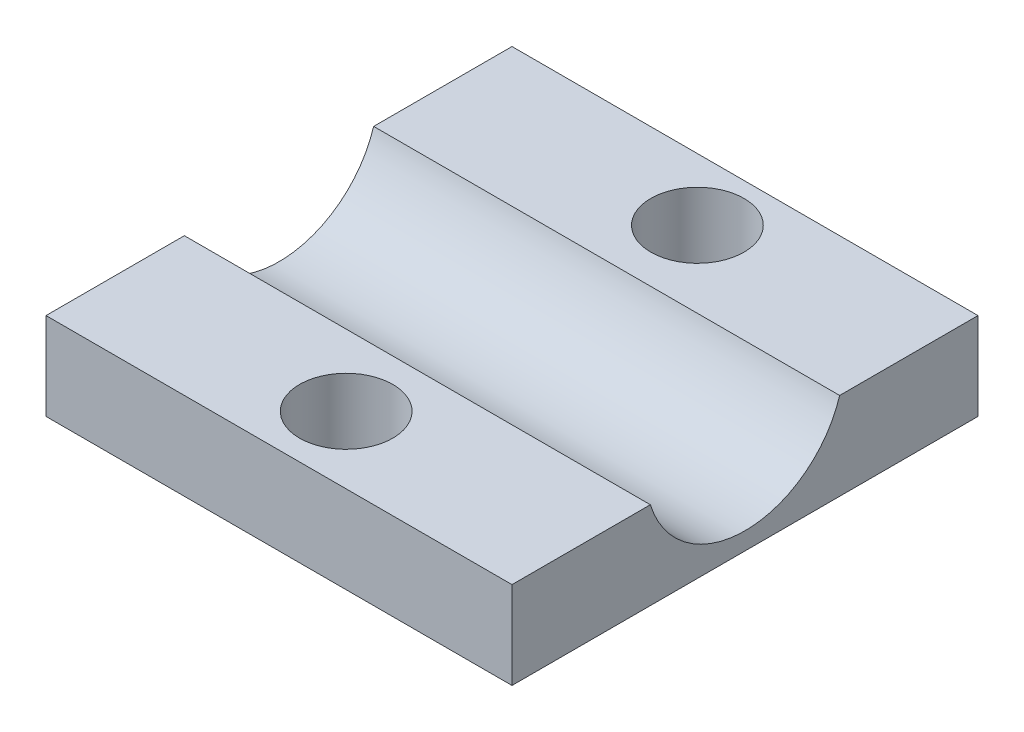
ISO-10303-21;
HEADER;
FILE_DESCRIPTION(('STEP AP214'),'2;1');
FILE_NAME('part.step','',(''),(''),'','','');
FILE_SCHEMA(('AUTOMOTIVE_DESIGN { 1 0 10303 214 1 1 1 1 }'));
ENDSEC;
DATA;
#1=APPLICATION_CONTEXT('core data for automotive mechanical design processes');
#2=APPLICATION_PROTOCOL_DEFINITION('international standard','automotive_design',2000,#1);
#3=PRODUCT_CONTEXT('',#1,'mechanical');
#4=PRODUCT('Part','Part','',(#3));
#5=PRODUCT_RELATED_PRODUCT_CATEGORY('part','',(#4));
#6=PRODUCT_DEFINITION_FORMATION('','',#4);
#7=PRODUCT_DEFINITION_CONTEXT('part definition',#1,'design');
#8=PRODUCT_DEFINITION('design','',#6,#7);
#9=PRODUCT_DEFINITION_SHAPE('','',#8);
#10=(LENGTH_UNIT() NAMED_UNIT(*) SI_UNIT(.MILLI.,.METRE.));
#11=(NAMED_UNIT(*) PLANE_ANGLE_UNIT() SI_UNIT($,.RADIAN.));
#12=(NAMED_UNIT(*) SI_UNIT($,.STERADIAN.) SOLID_ANGLE_UNIT());
#13=UNCERTAINTY_MEASURE_WITH_UNIT(LENGTH_MEASURE(1.E-05),#10,'distance_accuracy_value','');
#14=(GEOMETRIC_REPRESENTATION_CONTEXT(3) GLOBAL_UNCERTAINTY_ASSIGNED_CONTEXT((#13)) GLOBAL_UNIT_ASSIGNED_CONTEXT((#10,
#11,#12)) REPRESENTATION_CONTEXT('',''));
#15=CARTESIAN_POINT('',(0.,0.,0.));
#16=DIRECTION('',(0.,0.,1.));
#17=DIRECTION('',(1.,0.,0.));
#18=AXIS2_PLACEMENT_3D('',#15,#16,#17);
#19=CARTESIAN_POINT('',(0.,7.5,0.));
#20=DIRECTION('',(0.,1.,0.));
#21=DIRECTION('',(0.,0.,1.));
#22=AXIS2_PLACEMENT_3D('',#19,#20,#21);
#23=PLANE('',#22);
#24=CARTESIAN_POINT('',(1.24722686358325,7.5,-14.6672284541437));
#25=DIRECTION('',(0.,1.,0.));
#26=DIRECTION('',(0.,0.,1.));
#27=AXIS2_PLACEMENT_3D('',#24,#25,#26);
#28=CIRCLE('',#27,3.99999999999999);
#29=CARTESIAN_POINT('',(1.24722686358325,7.5,-10.6672284541437));
#30=VERTEX_POINT('',#29);
#31=EDGE_CURVE('E233',#30,#30,#28,.T.);
#32=ORIENTED_EDGE('',*,*,#31,.F.);
#33=EDGE_LOOP('',(#32));
#34=FACE_BOUND('',#33,.T.);
#35=DIRECTION('',(0.,0.,1.));
#36=VECTOR('',#35,1.);
#37=CARTESIAN_POINT('',(-20.,7.5,20.));
#38=LINE('',#37,#36);
#39=CARTESIAN_POINT('',(-20.,7.5,-20.));
#40=VERTEX_POINT('',#39);
#41=CARTESIAN_POINT('',(-20.,7.5,-8.12403840463596));
#42=VERTEX_POINT('',#41);
#43=EDGE_CURVE('E99',#40,#42,#38,.T.);
#44=ORIENTED_EDGE('',*,*,#43,.T.);
#45=DIRECTION('',(-1.,0.,0.));
#46=VECTOR('',#45,1.);
#47=CARTESIAN_POINT('',(20.,7.5,-8.12403840463596));
#48=LINE('',#47,#46);
#49=CARTESIAN_POINT('',(20.,7.5,-8.12403840463596));
#50=VERTEX_POINT('',#49);
#51=EDGE_CURVE('E11',#42,#50,#48,.F.);
#52=ORIENTED_EDGE('',*,*,#51,.T.);
#53=DIRECTION('',(0.,0.,-1.));
#54=VECTOR('',#53,1.);
#55=CARTESIAN_POINT('',(20.,7.5,20.));
#56=LINE('',#55,#54);
#57=CARTESIAN_POINT('',(20.,7.5,-20.));
#58=VERTEX_POINT('',#57);
#59=EDGE_CURVE('E105',#50,#58,#56,.T.);
#60=ORIENTED_EDGE('',*,*,#59,.T.);
#61=DIRECTION('',(-1.,0.,0.));
#62=VECTOR('',#61,1.);
#63=CARTESIAN_POINT('',(20.,7.5,-20.));
#64=LINE('',#63,#62);
#65=EDGE_CURVE('E57',#58,#40,#64,.T.);
#66=ORIENTED_EDGE('',*,*,#65,.T.);
#67=EDGE_LOOP('',(#44,#52,#60,#66));
#68=FACE_BOUND('',#67,.T.);
#69=ADVANCED_FACE('F33',(#34,#68),#23,.T.);
#70=CARTESIAN_POINT('',(0.,7.5,14.2327715458563));
#71=DIRECTION('',(0.,1.,0.));
#72=DIRECTION('',(0.,0.,1.));
#73=AXIS2_PLACEMENT_3D('',#70,#71,#72);
#74=CIRCLE('',#73,3.99999999999999);
#75=CARTESIAN_POINT('',(0.,7.5,18.2327715458563));
#76=VERTEX_POINT('',#75);
#77=EDGE_CURVE('E235',#76,#76,#74,.T.);
#78=ORIENTED_EDGE('',*,*,#77,.F.);
#79=EDGE_LOOP('',(#78));
#80=FACE_BOUND('',#79,.T.);
#81=CARTESIAN_POINT('',(20.,7.5,20.));
#82=VERTEX_POINT('',#81);
#83=CARTESIAN_POINT('',(20.,7.5,8.12403840463596));
#84=VERTEX_POINT('',#83);
#85=EDGE_CURVE('E109',#82,#84,#56,.T.);
#86=ORIENTED_EDGE('',*,*,#85,.T.);
#87=DIRECTION('',(-1.,0.,0.));
#88=VECTOR('',#87,1.);
#89=CARTESIAN_POINT('',(20.,7.5,8.12403840463596));
#90=LINE('',#89,#88);
#91=CARTESIAN_POINT('',(-20.,7.5,8.12403840463596));
#92=VERTEX_POINT('',#91);
#93=EDGE_CURVE('E41',#84,#92,#90,.T.);
#94=ORIENTED_EDGE('',*,*,#93,.T.);
#95=CARTESIAN_POINT('',(-20.,7.5,20.));
#96=VERTEX_POINT('',#95);
#97=EDGE_CURVE('E85',#92,#96,#38,.T.);
#98=ORIENTED_EDGE('',*,*,#97,.T.);
#99=DIRECTION('',(1.,0.,0.));
#100=VECTOR('',#99,1.);
#101=CARTESIAN_POINT('',(20.,7.5,20.));
#102=LINE('',#101,#100);
#103=EDGE_CURVE('E103',#96,#82,#102,.T.);
#104=ORIENTED_EDGE('',*,*,#103,.T.);
#105=EDGE_LOOP('',(#86,#94,#98,#104));
#106=FACE_BOUND('',#105,.T.);
#107=ADVANCED_FACE('F130',(#80,#106),#23,.T.);
#108=CARTESIAN_POINT('',(-20.,7.5,20.));
#109=DIRECTION('',(1.,0.,0.));
#110=DIRECTION('',(0.,0.,-1.));
#111=AXIS2_PLACEMENT_3D('',#108,#109,#110);
#112=PLANE('',#111);
#113=CARTESIAN_POINT('',(-20.,10.,0.));
#114=DIRECTION('',(1.,0.,0.));
#115=DIRECTION('',(0.,0.,-1.));
#116=AXIS2_PLACEMENT_3D('',#113,#114,#115);
#117=CIRCLE('',#116,8.5);
#118=EDGE_CURVE('E48',#92,#42,#117,.T.);
#119=ORIENTED_EDGE('',*,*,#118,.T.);
#120=ORIENTED_EDGE('',*,*,#43,.F.);
#121=DIRECTION('',(0.,-1.,0.));
#122=VECTOR('',#121,1.);
#123=CARTESIAN_POINT('',(-20.,7.5,-20.));
#124=LINE('',#123,#122);
#125=CARTESIAN_POINT('',(-20.,0.,-20.));
#126=VERTEX_POINT('',#125);
#127=EDGE_CURVE('E113',#40,#126,#124,.T.);
#128=ORIENTED_EDGE('',*,*,#127,.T.);
#129=DIRECTION('',(0.,0.,1.));
#130=VECTOR('',#129,1.);
#131=CARTESIAN_POINT('',(-20.,0.,20.));
#132=LINE('',#131,#130);
#133=CARTESIAN_POINT('',(-20.,0.,20.));
#134=VERTEX_POINT('',#133);
#135=EDGE_CURVE('E114',#126,#134,#132,.T.);
#136=ORIENTED_EDGE('',*,*,#135,.T.);
#137=DIRECTION('',(0.,-1.,0.));
#138=VECTOR('',#137,1.);
#139=CARTESIAN_POINT('',(-20.,7.5,20.));
#140=LINE('',#139,#138);
#141=EDGE_CURVE('E128',#96,#134,#140,.T.);
#142=ORIENTED_EDGE('',*,*,#141,.F.);
#143=ORIENTED_EDGE('',*,*,#97,.F.);
#144=EDGE_LOOP('',(#119,#120,#128,#136,#142,#143));
#145=FACE_BOUND('',#144,.T.);
#146=ADVANCED_FACE('F35',(#145),#112,.F.);
#147=CARTESIAN_POINT('',(20.,7.5,20.));
#148=DIRECTION('',(0.,0.,-1.));
#149=DIRECTION('',(-1.,0.,0.));
#150=AXIS2_PLACEMENT_3D('',#147,#148,#149);
#151=PLANE('',#150);
#152=DIRECTION('',(1.,0.,0.));
#153=VECTOR('',#152,1.);
#154=CARTESIAN_POINT('',(20.,0.,20.));
#155=LINE('',#154,#153);
#156=CARTESIAN_POINT('',(20.,0.,20.));
#157=VERTEX_POINT('',#156);
#158=EDGE_CURVE('E117',#134,#157,#155,.T.);
#159=ORIENTED_EDGE('',*,*,#158,.T.);
#160=DIRECTION('',(0.,-1.,0.));
#161=VECTOR('',#160,1.);
#162=CARTESIAN_POINT('',(20.,7.5,20.));
#163=LINE('',#162,#161);
#164=EDGE_CURVE('E125',#82,#157,#163,.T.);
#165=ORIENTED_EDGE('',*,*,#164,.F.);
#166=ORIENTED_EDGE('',*,*,#103,.F.);
#167=ORIENTED_EDGE('',*,*,#141,.T.);
#168=EDGE_LOOP('',(#159,#165,#166,#167));
#169=FACE_BOUND('',#168,.T.);
#170=ADVANCED_FACE('F142',(#169),#151,.F.);
#171=CARTESIAN_POINT('',(20.,7.5,20.));
#172=DIRECTION('',(-1.,0.,0.));
#173=DIRECTION('',(0.,0.,1.));
#174=AXIS2_PLACEMENT_3D('',#171,#172,#173);
#175=PLANE('',#174);
#176=CARTESIAN_POINT('',(20.,10.,0.));
#177=DIRECTION('',(1.,0.,0.));
#178=DIRECTION('',(0.,0.,-1.));
#179=AXIS2_PLACEMENT_3D('',#176,#177,#178);
#180=CIRCLE('',#179,8.5);
#181=EDGE_CURVE('E95',#84,#50,#180,.T.);
#182=ORIENTED_EDGE('',*,*,#181,.F.);
#183=ORIENTED_EDGE('',*,*,#85,.F.);
#184=ORIENTED_EDGE('',*,*,#164,.T.);
#185=DIRECTION('',(0.,0.,-1.));
#186=VECTOR('',#185,1.);
#187=CARTESIAN_POINT('',(20.,0.,20.));
#188=LINE('',#187,#186);
#189=CARTESIAN_POINT('',(20.,0.,-20.));
#190=VERTEX_POINT('',#189);
#191=EDGE_CURVE('E119',#157,#190,#188,.T.);
#192=ORIENTED_EDGE('',*,*,#191,.T.);
#193=DIRECTION('',(0.,-1.,0.));
#194=VECTOR('',#193,1.);
#195=CARTESIAN_POINT('',(20.,7.5,-20.));
#196=LINE('',#195,#194);
#197=EDGE_CURVE('E123',#58,#190,#196,.T.);
#198=ORIENTED_EDGE('',*,*,#197,.F.);
#199=ORIENTED_EDGE('',*,*,#59,.F.);
#200=EDGE_LOOP('',(#182,#183,#184,#192,#198,#199));
#201=FACE_BOUND('',#200,.T.);
#202=ADVANCED_FACE('F133',(#201),#175,.F.);
#203=CARTESIAN_POINT('',(20.,7.5,-20.));
#204=DIRECTION('',(0.,0.,1.));
#205=DIRECTION('',(1.,0.,0.));
#206=AXIS2_PLACEMENT_3D('',#203,#204,#205);
#207=PLANE('',#206);
#208=DIRECTION('',(-1.,0.,0.));
#209=VECTOR('',#208,1.);
#210=CARTESIAN_POINT('',(20.,0.,-20.));
#211=LINE('',#210,#209);
#212=EDGE_CURVE('E78',#190,#126,#211,.T.);
#213=ORIENTED_EDGE('',*,*,#212,.T.);
#214=ORIENTED_EDGE('',*,*,#127,.F.);
#215=ORIENTED_EDGE('',*,*,#65,.F.);
#216=ORIENTED_EDGE('',*,*,#197,.T.);
#217=EDGE_LOOP('',(#213,#214,#215,#216));
#218=FACE_BOUND('',#217,.T.);
#219=ADVANCED_FACE('F136',(#218),#207,.F.);
#220=CARTESIAN_POINT('',(0.,0.,0.));
#221=DIRECTION('',(0.,1.,0.));
#222=DIRECTION('',(0.,0.,1.));
#223=AXIS2_PLACEMENT_3D('',#220,#221,#222);
#224=PLANE('',#223);
#225=CARTESIAN_POINT('',(1.24722686358325,0.,-14.6672284541437));
#226=DIRECTION('',(0.,1.,0.));
#227=DIRECTION('',(0.,0.,1.));
#228=AXIS2_PLACEMENT_3D('',#225,#226,#227);
#229=CIRCLE('',#228,3.99999999999995);
#230=CARTESIAN_POINT('',(1.24722686358325,0.,-10.6672284541437));
#231=VERTEX_POINT('',#230);
#232=EDGE_CURVE('E231',#231,#231,#229,.T.);
#233=ORIENTED_EDGE('',*,*,#232,.T.);
#234=EDGE_LOOP('',(#233));
#235=FACE_BOUND('',#234,.T.);
#236=CARTESIAN_POINT('',(0.,0.,14.2327715458563));
#237=DIRECTION('',(0.,1.,0.));
#238=DIRECTION('',(0.,0.,1.));
#239=AXIS2_PLACEMENT_3D('',#236,#237,#238);
#240=CIRCLE('',#239,3.99999999999995);
#241=CARTESIAN_POINT('',(0.,0.,18.2327715458563));
#242=VERTEX_POINT('',#241);
#243=EDGE_CURVE('E101',#242,#242,#240,.T.);
#244=ORIENTED_EDGE('',*,*,#243,.T.);
#245=EDGE_LOOP('',(#244));
#246=FACE_BOUND('',#245,.T.);
#247=ORIENTED_EDGE('',*,*,#135,.F.);
#248=ORIENTED_EDGE('',*,*,#212,.F.);
#249=ORIENTED_EDGE('',*,*,#191,.F.);
#250=ORIENTED_EDGE('',*,*,#158,.F.);
#251=EDGE_LOOP('',(#247,#248,#249,#250));
#252=FACE_BOUND('',#251,.T.);
#253=ADVANCED_FACE('F139',(#235,#246,#252),#224,.F.);
#254=CARTESIAN_POINT('',(20.,10.,0.));
#255=DIRECTION('',(-1.,0.,0.));
#256=DIRECTION('',(0.,0.,1.));
#257=AXIS2_PLACEMENT_3D('',#254,#255,#256);
#258=CYLINDRICAL_SURFACE('',#257,8.5);
#259=ORIENTED_EDGE('',*,*,#118,.F.);
#260=ORIENTED_EDGE('',*,*,#93,.F.);
#261=ORIENTED_EDGE('',*,*,#181,.T.);
#262=ORIENTED_EDGE('',*,*,#51,.F.);
#263=EDGE_LOOP('',(#259,#260,#261,#262));
#264=FACE_BOUND('',#263,.T.);
#265=ADVANCED_FACE('F93',(#264),#258,.F.);
#266=CARTESIAN_POINT('',(0.,7.5,14.2327715458563));
#267=DIRECTION('',(0.,1.,0.));
#268=DIRECTION('',(0.,0.,1.));
#269=AXIS2_PLACEMENT_3D('',#266,#267,#268);
#270=CYLINDRICAL_SURFACE('',#269,3.99999999999997);
#271=ORIENTED_EDGE('',*,*,#243,.F.);
#272=EDGE_LOOP('',(#271));
#273=FACE_BOUND('',#272,.T.);
#274=ORIENTED_EDGE('',*,*,#77,.T.);
#275=EDGE_LOOP('',(#274));
#276=FACE_BOUND('',#275,.T.);
#277=ADVANCED_FACE('F181',(#273,#276),#270,.F.);
#278=CARTESIAN_POINT('',(1.24722686358325,7.5,-14.6672284541437));
#279=DIRECTION('',(0.,1.,0.));
#280=DIRECTION('',(0.,0.,1.));
#281=AXIS2_PLACEMENT_3D('',#278,#279,#280);
#282=CYLINDRICAL_SURFACE('',#281,3.99999999999997);
#283=ORIENTED_EDGE('',*,*,#232,.F.);
#284=EDGE_LOOP('',(#283));
#285=FACE_BOUND('',#284,.T.);
#286=ORIENTED_EDGE('',*,*,#31,.T.);
#287=EDGE_LOOP('',(#286));
#288=FACE_BOUND('',#287,.T.);
#289=ADVANCED_FACE('F186',(#285,#288),#282,.F.);
#290=CLOSED_SHELL('',(#69,#107,#146,#170,#202,#219,#253,#265,#277,#289));
#291=MANIFOLD_SOLID_BREP('B2',#290);
#292=ADVANCED_BREP_SHAPE_REPRESENTATION('',(#18,#291),#14);
#293=SHAPE_DEFINITION_REPRESENTATION(#9,#292);
ENDSEC;
END-ISO-10303-21;
